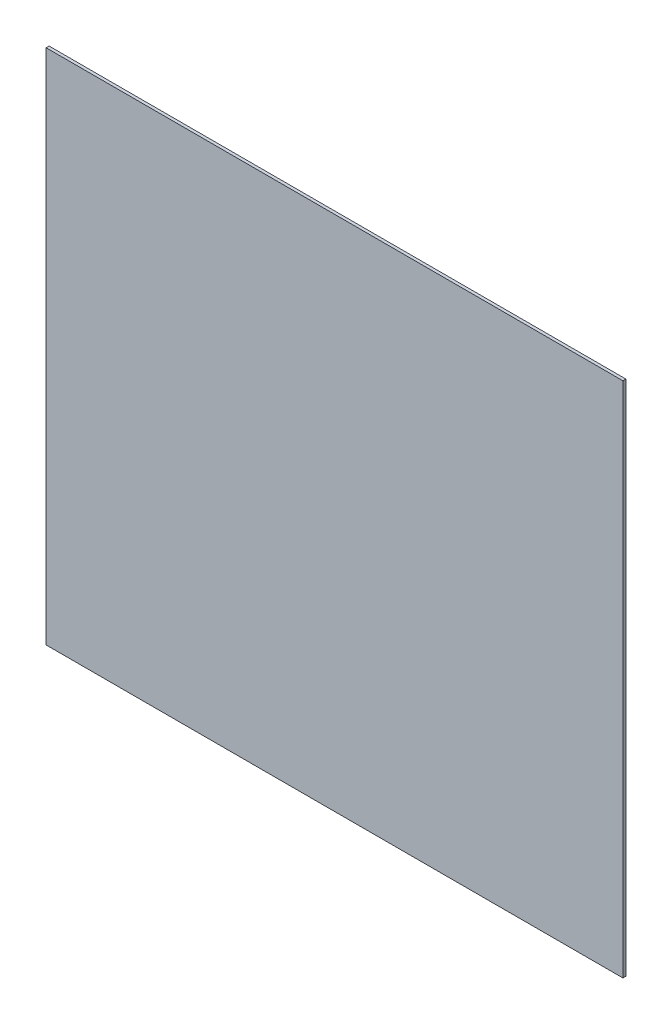
ISO-10303-21;
HEADER;
FILE_DESCRIPTION(('STEP AP214'),'2;1');
FILE_NAME('part.step','',(''),(''),'','','');
FILE_SCHEMA(('AUTOMOTIVE_DESIGN { 1 0 10303 214 1 1 1 1 }'));
ENDSEC;
DATA;
#1=APPLICATION_CONTEXT('core data for automotive mechanical design processes');
#2=APPLICATION_PROTOCOL_DEFINITION('international standard','automotive_design',2000,#1);
#3=PRODUCT_CONTEXT('',#1,'mechanical');
#4=PRODUCT('Part','Part','',(#3));
#5=PRODUCT_RELATED_PRODUCT_CATEGORY('part','',(#4));
#6=PRODUCT_DEFINITION_FORMATION('','',#4);
#7=PRODUCT_DEFINITION_CONTEXT('part definition',#1,'design');
#8=PRODUCT_DEFINITION('design','',#6,#7);
#9=PRODUCT_DEFINITION_SHAPE('','',#8);
#10=(LENGTH_UNIT() NAMED_UNIT(*) SI_UNIT(.MILLI.,.METRE.));
#11=(NAMED_UNIT(*) PLANE_ANGLE_UNIT() SI_UNIT($,.RADIAN.));
#12=(NAMED_UNIT(*) SI_UNIT($,.STERADIAN.) SOLID_ANGLE_UNIT());
#13=UNCERTAINTY_MEASURE_WITH_UNIT(LENGTH_MEASURE(1.E-05),#10,'distance_accuracy_value','');
#14=(GEOMETRIC_REPRESENTATION_CONTEXT(3) GLOBAL_UNCERTAINTY_ASSIGNED_CONTEXT((#13)) GLOBAL_UNIT_ASSIGNED_CONTEXT((#10,
#11,#12)) REPRESENTATION_CONTEXT('',''));
#15=CARTESIAN_POINT('',(0.,0.,0.));
#16=DIRECTION('',(0.,0.,1.));
#17=DIRECTION('',(1.,0.,0.));
#18=AXIS2_PLACEMENT_3D('',#15,#16,#17);
#19=CARTESIAN_POINT('',(0.,0.,-3.));
#20=DIRECTION('',(-1.,0.,0.));
#21=DIRECTION('',(0.,-1.,0.));
#22=AXIS2_PLACEMENT_3D('',#19,#20,#21);
#23=PLANE('',#22);
#24=DIRECTION('',(0.,-1.,0.));
#25=VECTOR('',#24,1.);
#26=CARTESIAN_POINT('',(0.,0.,0.));
#27=LINE('',#26,#25);
#28=CARTESIAN_POINT('',(0.,0.,0.));
#29=VERTEX_POINT('',#28);
#30=CARTESIAN_POINT('',(0.,-520.,0.));
#31=VERTEX_POINT('',#30);
#32=EDGE_CURVE('E102',#29,#31,#27,.T.);
#33=ORIENTED_EDGE('',*,*,#32,.F.);
#34=DIRECTION('',(0.,0.,1.));
#35=VECTOR('',#34,1.);
#36=CARTESIAN_POINT('',(0.,0.,-3.));
#37=LINE('',#36,#35);
#38=CARTESIAN_POINT('',(0.,0.,-3.));
#39=VERTEX_POINT('',#38);
#40=EDGE_CURVE('E11',#39,#29,#37,.T.);
#41=ORIENTED_EDGE('',*,*,#40,.F.);
#42=DIRECTION('',(0.,-1.,0.));
#43=VECTOR('',#42,1.);
#44=CARTESIAN_POINT('',(0.,0.,-3.));
#45=LINE('',#44,#43);
#46=CARTESIAN_POINT('',(0.,-520.,-3.));
#47=VERTEX_POINT('',#46);
#48=EDGE_CURVE('E96',#39,#47,#45,.T.);
#49=ORIENTED_EDGE('',*,*,#48,.T.);
#50=DIRECTION('',(0.,0.,1.));
#51=VECTOR('',#50,1.);
#52=CARTESIAN_POINT('',(0.,-520.,-3.));
#53=LINE('',#52,#51);
#54=EDGE_CURVE('E41',#47,#31,#53,.T.);
#55=ORIENTED_EDGE('',*,*,#54,.T.);
#56=EDGE_LOOP('',(#33,#41,#49,#55));
#57=FACE_BOUND('',#56,.T.);
#58=ADVANCED_FACE('F38',(#57),#23,.T.);
#59=CARTESIAN_POINT('',(0.,0.,-3.));
#60=DIRECTION('',(0.,1.,0.));
#61=DIRECTION('',(0.,0.,1.));
#62=AXIS2_PLACEMENT_3D('',#59,#60,#61);
#63=PLANE('',#62);
#64=DIRECTION('',(-1.,0.,0.));
#65=VECTOR('',#64,1.);
#66=CARTESIAN_POINT('',(0.,0.,0.));
#67=LINE('',#66,#65);
#68=CARTESIAN_POINT('',(580.,0.,0.));
#69=VERTEX_POINT('',#68);
#70=EDGE_CURVE('E98',#69,#29,#67,.T.);
#71=ORIENTED_EDGE('',*,*,#70,.F.);
#72=DIRECTION('',(0.,0.,1.));
#73=VECTOR('',#72,1.);
#74=CARTESIAN_POINT('',(580.,0.,-3.));
#75=LINE('',#74,#73);
#76=CARTESIAN_POINT('',(580.,0.,-3.));
#77=VERTEX_POINT('',#76);
#78=EDGE_CURVE('E47',#77,#69,#75,.T.);
#79=ORIENTED_EDGE('',*,*,#78,.F.);
#80=DIRECTION('',(-1.,0.,0.));
#81=VECTOR('',#80,1.);
#82=CARTESIAN_POINT('',(0.,0.,-3.));
#83=LINE('',#82,#81);
#84=EDGE_CURVE('E93',#77,#39,#83,.T.);
#85=ORIENTED_EDGE('',*,*,#84,.T.);
#86=ORIENTED_EDGE('',*,*,#40,.T.);
#87=EDGE_LOOP('',(#71,#79,#85,#86));
#88=FACE_BOUND('',#87,.T.);
#89=ADVANCED_FACE('F112',(#88),#63,.T.);
#90=CARTESIAN_POINT('',(580.,0.,-3.));
#91=DIRECTION('',(1.,0.,0.));
#92=DIRECTION('',(0.,1.,0.));
#93=AXIS2_PLACEMENT_3D('',#90,#91,#92);
#94=PLANE('',#93);
#95=DIRECTION('',(0.,1.,0.));
#96=VECTOR('',#95,1.);
#97=CARTESIAN_POINT('',(580.,0.,0.));
#98=LINE('',#97,#96);
#99=CARTESIAN_POINT('',(580.,-520.,0.));
#100=VERTEX_POINT('',#99);
#101=EDGE_CURVE('E88',#100,#69,#98,.T.);
#102=ORIENTED_EDGE('',*,*,#101,.F.);
#103=DIRECTION('',(0.,0.,1.));
#104=VECTOR('',#103,1.);
#105=CARTESIAN_POINT('',(580.,-520.,-3.));
#106=LINE('',#105,#104);
#107=CARTESIAN_POINT('',(580.,-520.,-3.));
#108=VERTEX_POINT('',#107);
#109=EDGE_CURVE('E83',#108,#100,#106,.T.);
#110=ORIENTED_EDGE('',*,*,#109,.F.);
#111=DIRECTION('',(0.,1.,0.));
#112=VECTOR('',#111,1.);
#113=CARTESIAN_POINT('',(580.,0.,-3.));
#114=LINE('',#113,#112);
#115=EDGE_CURVE('E86',#108,#77,#114,.T.);
#116=ORIENTED_EDGE('',*,*,#115,.T.);
#117=ORIENTED_EDGE('',*,*,#78,.T.);
#118=EDGE_LOOP('',(#102,#110,#116,#117));
#119=FACE_BOUND('',#118,.T.);
#120=ADVANCED_FACE('F85',(#119),#94,.T.);
#121=CARTESIAN_POINT('',(0.,-520.,-3.));
#122=DIRECTION('',(0.,-1.,0.));
#123=DIRECTION('',(0.,0.,-1.));
#124=AXIS2_PLACEMENT_3D('',#121,#122,#123);
#125=PLANE('',#124);
#126=DIRECTION('',(1.,0.,0.));
#127=VECTOR('',#126,1.);
#128=CARTESIAN_POINT('',(0.,-520.,0.));
#129=LINE('',#128,#127);
#130=EDGE_CURVE('E105',#31,#100,#129,.T.);
#131=ORIENTED_EDGE('',*,*,#130,.F.);
#132=ORIENTED_EDGE('',*,*,#54,.F.);
#133=DIRECTION('',(1.,0.,0.));
#134=VECTOR('',#133,1.);
#135=CARTESIAN_POINT('',(0.,-520.,-3.));
#136=LINE('',#135,#134);
#137=EDGE_CURVE('E92',#47,#108,#136,.T.);
#138=ORIENTED_EDGE('',*,*,#137,.T.);
#139=ORIENTED_EDGE('',*,*,#109,.T.);
#140=EDGE_LOOP('',(#131,#132,#138,#139));
#141=FACE_BOUND('',#140,.T.);
#142=ADVANCED_FACE('F95',(#141),#125,.T.);
#143=CARTESIAN_POINT('',(0.,0.,-3.));
#144=DIRECTION('',(0.,0.,1.));
#145=DIRECTION('',(1.,0.,0.));
#146=AXIS2_PLACEMENT_3D('',#143,#144,#145);
#147=PLANE('',#146);
#148=ORIENTED_EDGE('',*,*,#48,.F.);
#149=ORIENTED_EDGE('',*,*,#84,.F.);
#150=ORIENTED_EDGE('',*,*,#115,.F.);
#151=ORIENTED_EDGE('',*,*,#137,.F.);
#152=EDGE_LOOP('',(#148,#149,#150,#151));
#153=FACE_BOUND('',#152,.T.);
#154=ADVANCED_FACE('F91',(#153),#147,.F.);
#155=CARTESIAN_POINT('',(0.,0.,0.));
#156=DIRECTION('',(0.,0.,1.));
#157=DIRECTION('',(1.,0.,0.));
#158=AXIS2_PLACEMENT_3D('',#155,#156,#157);
#159=PLANE('',#158);
#160=ORIENTED_EDGE('',*,*,#32,.T.);
#161=ORIENTED_EDGE('',*,*,#130,.T.);
#162=ORIENTED_EDGE('',*,*,#101,.T.);
#163=ORIENTED_EDGE('',*,*,#70,.T.);
#164=EDGE_LOOP('',(#160,#161,#162,#163));
#165=FACE_BOUND('',#164,.T.);
#166=ADVANCED_FACE('F111',(#165),#159,.T.);
#167=CLOSED_SHELL('',(#58,#89,#120,#142,#154,#166));
#168=MANIFOLD_SOLID_BREP('B2',#167);
#169=ADVANCED_BREP_SHAPE_REPRESENTATION('',(#18,#168),#14);
#170=SHAPE_DEFINITION_REPRESENTATION(#9,#169);
ENDSEC;
END-ISO-10303-21;
